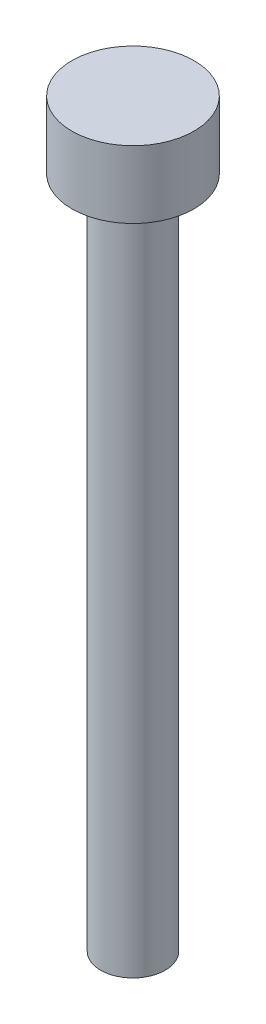
ISO-10303-21;
HEADER;
FILE_DESCRIPTION(('STEP AP214'),'2;1');
FILE_NAME('part.step','',(''),(''),'','','');
FILE_SCHEMA(('AUTOMOTIVE_DESIGN { 1 0 10303 214 1 1 1 1 }'));
ENDSEC;
DATA;
#1=APPLICATION_CONTEXT('core data for automotive mechanical design processes');
#2=APPLICATION_PROTOCOL_DEFINITION('international standard','automotive_design',2000,#1);
#3=PRODUCT_CONTEXT('',#1,'mechanical');
#4=PRODUCT('Part','Part','',(#3));
#5=PRODUCT_RELATED_PRODUCT_CATEGORY('part','',(#4));
#6=PRODUCT_DEFINITION_FORMATION('','',#4);
#7=PRODUCT_DEFINITION_CONTEXT('part definition',#1,'design');
#8=PRODUCT_DEFINITION('design','',#6,#7);
#9=PRODUCT_DEFINITION_SHAPE('','',#8);
#10=(LENGTH_UNIT() NAMED_UNIT(*) SI_UNIT(.MILLI.,.METRE.));
#11=(NAMED_UNIT(*) PLANE_ANGLE_UNIT() SI_UNIT($,.RADIAN.));
#12=(NAMED_UNIT(*) SI_UNIT($,.STERADIAN.) SOLID_ANGLE_UNIT());
#13=UNCERTAINTY_MEASURE_WITH_UNIT(LENGTH_MEASURE(1.E-05),#10,'distance_accuracy_value','');
#14=(GEOMETRIC_REPRESENTATION_CONTEXT(3) GLOBAL_UNCERTAINTY_ASSIGNED_CONTEXT((#13)) GLOBAL_UNIT_ASSIGNED_CONTEXT((#10,
#11,#12)) REPRESENTATION_CONTEXT('',''));
#15=CARTESIAN_POINT('',(0.,0.,0.));
#16=DIRECTION('',(0.,0.,1.));
#17=DIRECTION('',(1.,0.,0.));
#18=AXIS2_PLACEMENT_3D('',#15,#16,#17);
#19=CARTESIAN_POINT('',(0.,3.,0.));
#20=DIRECTION('',(0.,-1.,0.));
#21=DIRECTION('',(0.,0.,-1.));
#22=AXIS2_PLACEMENT_3D('',#19,#20,#21);
#23=CYLINDRICAL_SURFACE('',#22,2.72);
#24=CARTESIAN_POINT('',(0.,3.,0.));
#25=DIRECTION('',(0.,1.,0.));
#26=DIRECTION('',(0.,0.,1.));
#27=AXIS2_PLACEMENT_3D('',#24,#25,#26);
#28=CIRCLE('',#27,2.72);
#29=CARTESIAN_POINT('',(0.,3.,2.72));
#30=VERTEX_POINT('',#29);
#31=EDGE_CURVE('E40',#30,#30,#28,.T.);
#32=ORIENTED_EDGE('',*,*,#31,.F.);
#33=EDGE_LOOP('',(#32));
#34=FACE_BOUND('',#33,.T.);
#35=CARTESIAN_POINT('',(0.,0.,0.));
#36=DIRECTION('',(0.,1.,0.));
#37=DIRECTION('',(0.,0.,1.));
#38=AXIS2_PLACEMENT_3D('',#35,#36,#37);
#39=CIRCLE('',#38,2.72);
#40=CARTESIAN_POINT('',(0.,0.,2.72));
#41=VERTEX_POINT('',#40);
#42=EDGE_CURVE('E36',#41,#41,#39,.T.);
#43=ORIENTED_EDGE('',*,*,#42,.T.);
#44=EDGE_LOOP('',(#43));
#45=FACE_BOUND('',#44,.T.);
#46=ADVANCED_FACE('F33',(#34,#45),#23,.T.);
#47=CARTESIAN_POINT('',(0.,3.,0.));
#48=DIRECTION('',(0.,1.,0.));
#49=DIRECTION('',(0.,0.,1.));
#50=AXIS2_PLACEMENT_3D('',#47,#48,#49);
#51=PLANE('',#50);
#52=ORIENTED_EDGE('',*,*,#31,.T.);
#53=EDGE_LOOP('',(#52));
#54=FACE_BOUND('',#53,.T.);
#55=ADVANCED_FACE('F57',(#54),#51,.T.);
#56=CARTESIAN_POINT('',(0.,0.,0.));
#57=DIRECTION('',(0.,1.,0.));
#58=DIRECTION('',(0.,0.,1.));
#59=AXIS2_PLACEMENT_3D('',#56,#57,#58);
#60=PLANE('',#59);
#61=CARTESIAN_POINT('',(0.,0.,0.));
#62=DIRECTION('',(0.,-1.,0.));
#63=DIRECTION('',(0.,0.,-1.));
#64=AXIS2_PLACEMENT_3D('',#61,#62,#63);
#65=CIRCLE('',#64,1.44);
#66=CARTESIAN_POINT('',(0.,0.,-1.44));
#67=VERTEX_POINT('',#66);
#68=EDGE_CURVE('E10',#67,#67,#65,.T.);
#69=ORIENTED_EDGE('',*,*,#68,.F.);
#70=EDGE_LOOP('',(#69));
#71=FACE_BOUND('',#70,.T.);
#72=ORIENTED_EDGE('',*,*,#42,.F.);
#73=EDGE_LOOP('',(#72));
#74=FACE_BOUND('',#73,.T.);
#75=ADVANCED_FACE('F54',(#71,#74),#60,.F.);
#76=CARTESIAN_POINT('',(0.,-30.,0.));
#77=DIRECTION('',(0.,1.,0.));
#78=DIRECTION('',(0.,0.,1.));
#79=AXIS2_PLACEMENT_3D('',#76,#77,#78);
#80=CYLINDRICAL_SURFACE('',#79,1.44);
#81=CARTESIAN_POINT('',(0.,-30.,0.));
#82=DIRECTION('',(0.,-1.,0.));
#83=DIRECTION('',(0.,0.,-1.));
#84=AXIS2_PLACEMENT_3D('',#81,#82,#83);
#85=CIRCLE('',#84,1.44);
#86=CARTESIAN_POINT('',(0.,-30.,-1.44));
#87=VERTEX_POINT('',#86);
#88=EDGE_CURVE('E46',#87,#87,#85,.T.);
#89=ORIENTED_EDGE('',*,*,#88,.F.);
#90=EDGE_LOOP('',(#89));
#91=FACE_BOUND('',#90,.T.);
#92=ORIENTED_EDGE('',*,*,#68,.T.);
#93=EDGE_LOOP('',(#92));
#94=FACE_BOUND('',#93,.T.);
#95=ADVANCED_FACE('F56',(#91,#94),#80,.T.);
#96=CARTESIAN_POINT('',(0.,-30.,0.));
#97=DIRECTION('',(0.,-1.,0.));
#98=DIRECTION('',(0.,0.,-1.));
#99=AXIS2_PLACEMENT_3D('',#96,#97,#98);
#100=PLANE('',#99);
#101=ORIENTED_EDGE('',*,*,#88,.T.);
#102=EDGE_LOOP('',(#101));
#103=FACE_BOUND('',#102,.T.);
#104=ADVANCED_FACE('F63',(#103),#100,.T.);
#105=CLOSED_SHELL('',(#46,#55,#75,#95,#104));
#106=MANIFOLD_SOLID_BREP('B2',#105);
#107=ADVANCED_BREP_SHAPE_REPRESENTATION('',(#18,#106),#14);
#108=SHAPE_DEFINITION_REPRESENTATION(#9,#107);
ENDSEC;
END-ISO-10303-21;
